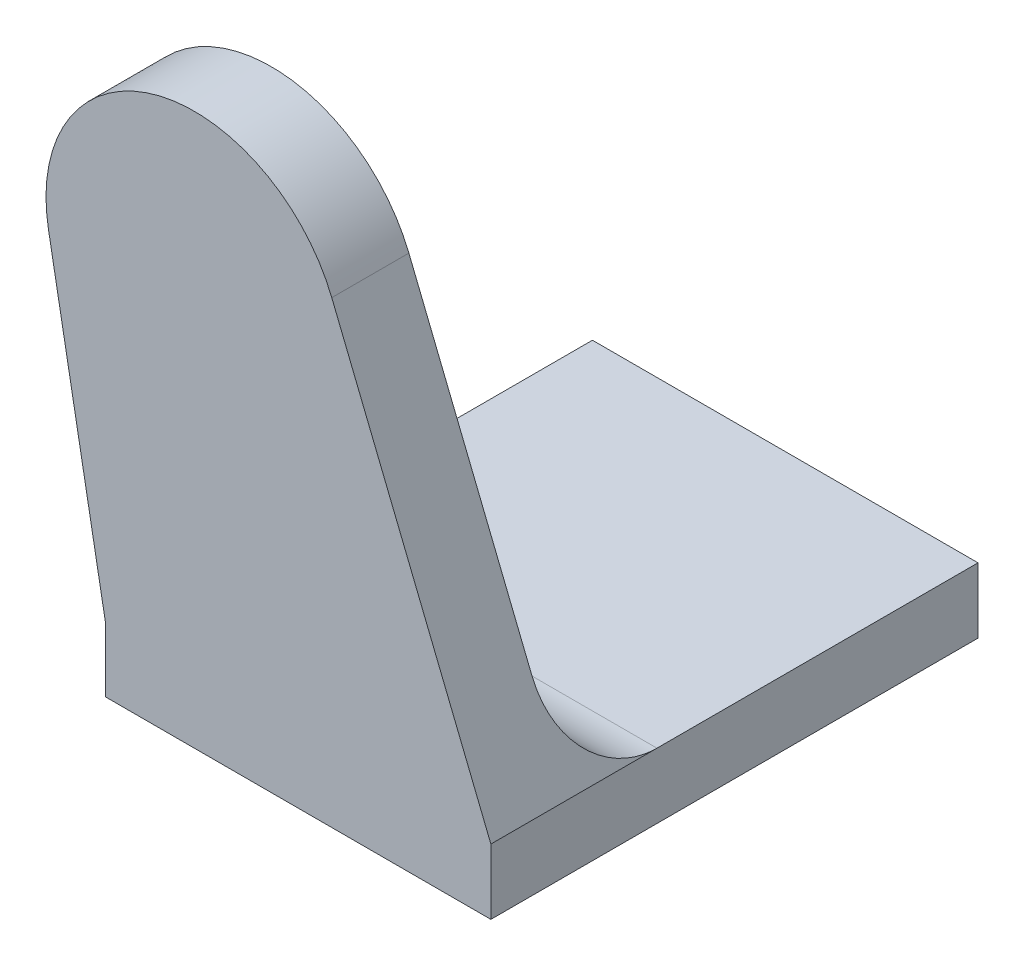
ISO-10303-21;
HEADER;
FILE_DESCRIPTION(('STEP AP214'),'2;1');
FILE_NAME('part.step','',(''),(''),'','','');
FILE_SCHEMA(('AUTOMOTIVE_DESIGN { 1 0 10303 214 1 1 1 1 }'));
ENDSEC;
DATA;
#1=APPLICATION_CONTEXT('core data for automotive mechanical design processes');
#2=APPLICATION_PROTOCOL_DEFINITION('international standard','automotive_design',2000,#1);
#3=PRODUCT_CONTEXT('',#1,'mechanical');
#4=PRODUCT('Part','Part','',(#3));
#5=PRODUCT_RELATED_PRODUCT_CATEGORY('part','',(#4));
#6=PRODUCT_DEFINITION_FORMATION('','',#4);
#7=PRODUCT_DEFINITION_CONTEXT('part definition',#1,'design');
#8=PRODUCT_DEFINITION('design','',#6,#7);
#9=PRODUCT_DEFINITION_SHAPE('','',#8);
#10=(LENGTH_UNIT() NAMED_UNIT(*) SI_UNIT(.MILLI.,.METRE.));
#11=(NAMED_UNIT(*) PLANE_ANGLE_UNIT() SI_UNIT($,.RADIAN.));
#12=(NAMED_UNIT(*) SI_UNIT($,.STERADIAN.) SOLID_ANGLE_UNIT());
#13=UNCERTAINTY_MEASURE_WITH_UNIT(LENGTH_MEASURE(1.E-05),#10,'distance_accuracy_value','');
#14=(GEOMETRIC_REPRESENTATION_CONTEXT(3) GLOBAL_UNCERTAINTY_ASSIGNED_CONTEXT((#13)) GLOBAL_UNIT_ASSIGNED_CONTEXT((#10,
#11,#12)) REPRESENTATION_CONTEXT('',''));
#15=CARTESIAN_POINT('',(0.,0.,0.));
#16=DIRECTION('',(0.,0.,1.));
#17=DIRECTION('',(1.,0.,0.));
#18=AXIS2_PLACEMENT_3D('',#15,#16,#17);
#19=CARTESIAN_POINT('',(0.,-93.2998175726996,0.));
#20=DIRECTION('',(0.,-1.,0.));
#21=DIRECTION('',(0.,0.,-1.));
#22=AXIS2_PLACEMENT_3D('',#19,#20,#21);
#23=PLANE('',#22);
#24=DIRECTION('',(0.,0.,-1.));
#25=VECTOR('',#24,1.);
#26=CARTESIAN_POINT('',(23.0000603569878,-93.2998175726996,12.45));
#27=LINE('',#26,#25);
#28=CARTESIAN_POINT('',(23.0000603569878,-93.2998175726996,6.85000000000001));
#29=VERTEX_POINT('',#28);
#30=CARTESIAN_POINT('',(23.0000603569878,-93.2998175726996,-3.97499999999999));
#31=VERTEX_POINT('',#30);
#32=EDGE_CURVE('E112',#29,#31,#27,.T.);
#33=ORIENTED_EDGE('',*,*,#32,.T.);
#34=DIRECTION('',(1.,0.,0.));
#35=VECTOR('',#34,1.);
#36=CARTESIAN_POINT('',(23.0000603569878,-93.2998175726996,-3.97499999999999));
#37=LINE('',#36,#35);
#38=CARTESIAN_POINT('',(9.99982028537325,-93.2998175726996,-3.97499999999999));
#39=VERTEX_POINT('',#38);
#40=EDGE_CURVE('E119',#39,#31,#37,.T.);
#41=ORIENTED_EDGE('',*,*,#40,.F.);
#42=DIRECTION('',(0.,0.,1.));
#43=VECTOR('',#42,1.);
#44=CARTESIAN_POINT('',(9.99982028537324,-93.2998175726996,12.45));
#45=LINE('',#44,#43);
#46=CARTESIAN_POINT('',(9.99982028537324,-93.2998175726996,6.85));
#47=VERTEX_POINT('',#46);
#48=EDGE_CURVE('E168',#39,#47,#45,.T.);
#49=ORIENTED_EDGE('',*,*,#48,.T.);
#50=DIRECTION('',(-1.,0.,0.));
#51=VECTOR('',#50,1.);
#52=CARTESIAN_POINT('',(9.99982028537324,-93.2998175726996,6.85));
#53=LINE('',#52,#51);
#54=EDGE_CURVE('E127',#29,#47,#53,.T.);
#55=ORIENTED_EDGE('',*,*,#54,.F.);
#56=EDGE_LOOP('',(#33,#41,#49,#55));
#57=FACE_BOUND('',#56,.T.);
#58=ADVANCED_FACE('F34',(#57),#23,.F.);
#59=CARTESIAN_POINT('',(23.0000603569878,-95.4998175726996,12.45));
#60=DIRECTION('',(-1.,0.,0.));
#61=DIRECTION('',(0.,0.,-1.));
#62=AXIS2_PLACEMENT_3D('',#59,#60,#61);
#63=PLANE('',#62);
#64=CARTESIAN_POINT('',(23.0000603569878,-93.2998175726996,12.45));
#65=VERTEX_POINT('',#64);
#66=EDGE_CURVE('E172',#65,#29,#27,.T.);
#67=ORIENTED_EDGE('',*,*,#66,.F.);
#68=DIRECTION('',(0.,1.,0.));
#69=VECTOR('',#68,1.);
#70=CARTESIAN_POINT('',(23.0000603569878,-95.4998175726996,12.45));
#71=LINE('',#70,#69);
#72=CARTESIAN_POINT('',(23.0000603569878,-95.4998175726996,12.45));
#73=VERTEX_POINT('',#72);
#74=EDGE_CURVE('E116',#73,#65,#71,.T.);
#75=ORIENTED_EDGE('',*,*,#74,.F.);
#76=DIRECTION('',(0.,0.,-1.));
#77=VECTOR('',#76,1.);
#78=CARTESIAN_POINT('',(23.0000603569878,-95.4998175726996,12.45));
#79=LINE('',#78,#77);
#80=CARTESIAN_POINT('',(23.0000603569878,-95.4998175726996,-3.97499999999999));
#81=VERTEX_POINT('',#80);
#82=EDGE_CURVE('E115',#73,#81,#79,.T.);
#83=ORIENTED_EDGE('',*,*,#82,.T.);
#84=DIRECTION('',(0.,-1.,0.));
#85=VECTOR('',#84,1.);
#86=CARTESIAN_POINT('',(23.0000603569878,-93.2998175726996,-3.97499999999999));
#87=LINE('',#86,#85);
#88=EDGE_CURVE('E107',#31,#81,#87,.T.);
#89=ORIENTED_EDGE('',*,*,#88,.F.);
#90=ORIENTED_EDGE('',*,*,#32,.F.);
#91=EDGE_LOOP('',(#67,#75,#83,#89,#90));
#92=FACE_BOUND('',#91,.T.);
#93=ADVANCED_FACE('F110',(#92),#63,.F.);
#94=CARTESIAN_POINT('',(9.99982028537324,-95.4998175726996,12.45));
#95=DIRECTION('',(1.,0.,0.));
#96=DIRECTION('',(0.,0.,1.));
#97=AXIS2_PLACEMENT_3D('',#94,#95,#96);
#98=PLANE('',#97);
#99=DIRECTION('',(0.,0.,1.));
#100=VECTOR('',#99,1.);
#101=CARTESIAN_POINT('',(9.99982028537324,-95.4998175726996,12.45));
#102=LINE('',#101,#100);
#103=CARTESIAN_POINT('',(9.99982028537324,-95.4998175726996,-3.97499999999998));
#104=VERTEX_POINT('',#103);
#105=CARTESIAN_POINT('',(9.99982028537324,-95.4998175726996,12.45));
#106=VERTEX_POINT('',#105);
#107=EDGE_CURVE('E164',#104,#106,#102,.T.);
#108=ORIENTED_EDGE('',*,*,#107,.T.);
#109=DIRECTION('',(0.,1.,0.));
#110=VECTOR('',#109,1.);
#111=CARTESIAN_POINT('',(9.99982028537324,-95.4998175726996,12.45));
#112=LINE('',#111,#110);
#113=CARTESIAN_POINT('',(9.99982028537324,-93.2998175726996,12.45));
#114=VERTEX_POINT('',#113);
#115=EDGE_CURVE('E154',#106,#114,#112,.T.);
#116=ORIENTED_EDGE('',*,*,#115,.T.);
#117=DIRECTION('',(0.,0.,-1.));
#118=VECTOR('',#117,1.);
#119=CARTESIAN_POINT('',(9.99982028537324,-93.2998175726996,12.45));
#120=LINE('',#119,#118);
#121=EDGE_CURVE('E140',#114,#47,#120,.T.);
#122=ORIENTED_EDGE('',*,*,#121,.T.);
#123=ORIENTED_EDGE('',*,*,#48,.F.);
#124=DIRECTION('',(0.,-1.,0.));
#125=VECTOR('',#124,1.);
#126=CARTESIAN_POINT('',(9.99982028537325,-93.2998175726996,-3.97499999999999));
#127=LINE('',#126,#125);
#128=EDGE_CURVE('E121',#39,#104,#127,.T.);
#129=ORIENTED_EDGE('',*,*,#128,.T.);
#130=EDGE_LOOP('',(#108,#116,#122,#123,#129));
#131=FACE_BOUND('',#130,.T.);
#132=ADVANCED_FACE('F196',(#131),#98,.F.);
#133=CARTESIAN_POINT('',(0.,-95.4998175726996,0.));
#134=DIRECTION('',(0.,-1.,0.));
#135=DIRECTION('',(0.,0.,-1.));
#136=AXIS2_PLACEMENT_3D('',#133,#134,#135);
#137=PLANE('',#136);
#138=DIRECTION('',(1.,0.,0.));
#139=VECTOR('',#138,1.);
#140=CARTESIAN_POINT('',(23.0000603569878,-95.4998175726996,-3.97499999999999));
#141=LINE('',#140,#139);
#142=EDGE_CURVE('E73',#104,#81,#141,.T.);
#143=ORIENTED_EDGE('',*,*,#142,.T.);
#144=ORIENTED_EDGE('',*,*,#82,.F.);
#145=DIRECTION('',(1.,0.,0.));
#146=VECTOR('',#145,1.);
#147=CARTESIAN_POINT('',(23.0000603569878,-95.4998175726996,12.45));
#148=LINE('',#147,#146);
#149=EDGE_CURVE('E167',#106,#73,#148,.T.);
#150=ORIENTED_EDGE('',*,*,#149,.F.);
#151=ORIENTED_EDGE('',*,*,#107,.F.);
#152=EDGE_LOOP('',(#143,#144,#150,#151));
#153=FACE_BOUND('',#152,.T.);
#154=ADVANCED_FACE('F194',(#153),#137,.T.);
#155=CARTESIAN_POINT('',(23.0000603569878,-95.4998175726996,12.45));
#156=DIRECTION('',(0.,0.,-1.));
#157=DIRECTION('',(1.,0.,0.));
#158=AXIS2_PLACEMENT_3D('',#155,#156,#157);
#159=PLANE('',#158);
#160=ORIENTED_EDGE('',*,*,#115,.F.);
#161=ORIENTED_EDGE('',*,*,#149,.T.);
#162=ORIENTED_EDGE('',*,*,#74,.T.);
#163=DIRECTION('',(0.374703363464617,-0.927144751054712,0.));
#164=VECTOR('',#163,1.);
#165=CARTESIAN_POINT('',(23.0000603569878,-93.2998175726996,12.45));
#166=LINE('',#165,#164);
#167=CARTESIAN_POINT('',(17.6355329929038,-80.0261353150554,12.45));
#168=VERTEX_POINT('',#167);
#169=EDGE_CURVE('E141',#168,#65,#166,.T.);
#170=ORIENTED_EDGE('',*,*,#169,.F.);
#171=CARTESIAN_POINT('',(12.9998092376302,-81.8996521323785,12.45));
#172=DIRECTION('',(0.,0.,-1.));
#173=DIRECTION('',(-1.,0.,0.));
#174=AXIS2_PLACEMENT_3D('',#171,#172,#173);
#175=CIRCLE('',#174,5.);
#176=CARTESIAN_POINT('',(8.08122186795485,-82.7982612169476,12.45));
#177=VERTEX_POINT('',#176);
#178=EDGE_CURVE('E145',#177,#168,#175,.T.);
#179=ORIENTED_EDGE('',*,*,#178,.F.);
#180=DIRECTION('',(-0.179721816913822,0.98371747393507,0.));
#181=VECTOR('',#180,1.);
#182=CARTESIAN_POINT('',(9.99982028537324,-93.2998175726996,12.45));
#183=LINE('',#182,#181);
#184=EDGE_CURVE('E152',#114,#177,#183,.T.);
#185=ORIENTED_EDGE('',*,*,#184,.F.);
#186=EDGE_LOOP('',(#160,#161,#162,#170,#179,#185));
#187=FACE_BOUND('',#186,.T.);
#188=ADVANCED_FACE('F191',(#187),#159,.F.);
#189=CARTESIAN_POINT('',(9.99982028537324,-93.2998175726996,12.45));
#190=DIRECTION('',(0.98371747393507,0.179721816913822,0.));
#191=DIRECTION('',(0.179721816913822,-0.98371747393507,0.));
#192=AXIS2_PLACEMENT_3D('',#189,#190,#191);
#193=PLANE('',#192);
#194=ORIENTED_EDGE('',*,*,#121,.F.);
#195=ORIENTED_EDGE('',*,*,#184,.T.);
#196=DIRECTION('',(0.,0.,-1.));
#197=VECTOR('',#196,1.);
#198=CARTESIAN_POINT('',(8.08122186795485,-82.7982612169476,12.45));
#199=LINE('',#198,#197);
#200=CARTESIAN_POINT('',(8.08122186795485,-82.7982612169476,9.85));
#201=VERTEX_POINT('',#200);
#202=EDGE_CURVE('E138',#177,#201,#199,.T.);
#203=ORIENTED_EDGE('',*,*,#202,.T.);
#204=DIRECTION('',(-0.179721816913822,0.98371747393507,0.));
#205=VECTOR('',#204,1.);
#206=CARTESIAN_POINT('',(9.99982028537324,-93.2998175726996,9.85));
#207=LINE('',#206,#205);
#208=CARTESIAN_POINT('',(9.45173054921689,-90.2998175726996,9.85));
#209=VERTEX_POINT('',#208);
#210=EDGE_CURVE('E135',#209,#201,#207,.T.);
#211=ORIENTED_EDGE('',*,*,#210,.F.);
#212=CARTESIAN_POINT('',(9.45173054921689,-90.2998175726996,6.85));
#213=DIRECTION('',(-0.98371747393507,-0.179721816913822,0.));
#214=DIRECTION('',(0.179721816913822,-0.98371747393507,0.));
#215=AXIS2_PLACEMENT_3D('',#212,#213,#214);
#216=ELLIPSE('',#215,3.04965610501905,3.);
#217=EDGE_CURVE('E42',#47,#209,#216,.T.);
#218=ORIENTED_EDGE('',*,*,#217,.F.);
#219=EDGE_LOOP('',(#194,#195,#203,#211,#218));
#220=FACE_BOUND('',#219,.T.);
#221=ADVANCED_FACE('F136',(#220),#193,.F.);
#222=CARTESIAN_POINT('',(12.9998092376302,-81.8996521323785,12.45));
#223=DIRECTION('',(0.,0.,-1.));
#224=DIRECTION('',(1.,0.,0.));
#225=AXIS2_PLACEMENT_3D('',#222,#223,#224);
#226=CYLINDRICAL_SURFACE('',#225,5.);
#227=CARTESIAN_POINT('',(12.9998092376302,-81.8996521323785,9.85));
#228=DIRECTION('',(0.,0.,-1.));
#229=DIRECTION('',(-1.,0.,0.));
#230=AXIS2_PLACEMENT_3D('',#227,#228,#229);
#231=CIRCLE('',#230,5.);
#232=CARTESIAN_POINT('',(17.6355329929038,-80.0261353150554,9.85));
#233=VERTEX_POINT('',#232);
#234=EDGE_CURVE('E143',#201,#233,#231,.T.);
#235=ORIENTED_EDGE('',*,*,#234,.F.);
#236=ORIENTED_EDGE('',*,*,#202,.F.);
#237=ORIENTED_EDGE('',*,*,#178,.T.);
#238=DIRECTION('',(0.,0.,-1.));
#239=VECTOR('',#238,1.);
#240=CARTESIAN_POINT('',(17.6355329929038,-80.0261353150554,12.45));
#241=LINE('',#240,#239);
#242=EDGE_CURVE('E159',#168,#233,#241,.T.);
#243=ORIENTED_EDGE('',*,*,#242,.T.);
#244=EDGE_LOOP('',(#235,#236,#237,#243));
#245=FACE_BOUND('',#244,.T.);
#246=ADVANCED_FACE('F186',(#245),#226,.T.);
#247=CARTESIAN_POINT('',(23.0000603569878,-93.2998175726996,12.45));
#248=DIRECTION('',(-0.927144751054712,-0.374703363464617,0.));
#249=DIRECTION('',(-0.374703363464617,0.927144751054712,0.));
#250=AXIS2_PLACEMENT_3D('',#247,#248,#249);
#251=PLANE('',#250);
#252=DIRECTION('',(0.374703363464617,-0.927144751054712,0.));
#253=VECTOR('',#252,1.);
#254=CARTESIAN_POINT('',(23.0000603569878,-93.2998175726996,9.85));
#255=LINE('',#254,#253);
#256=CARTESIAN_POINT('',(21.7876174357341,-90.2998175726996,9.85));
#257=VERTEX_POINT('',#256);
#258=EDGE_CURVE('E180',#233,#257,#255,.T.);
#259=ORIENTED_EDGE('',*,*,#258,.F.);
#260=ORIENTED_EDGE('',*,*,#242,.F.);
#261=ORIENTED_EDGE('',*,*,#169,.T.);
#262=ORIENTED_EDGE('',*,*,#66,.T.);
#263=CARTESIAN_POINT('',(21.7876174357341,-90.2998175726996,6.85));
#264=DIRECTION('',(0.927144751054712,0.374703363464617,0.));
#265=DIRECTION('',(0.374703363464617,-0.927144751054712,0.));
#266=AXIS2_PLACEMENT_3D('',#263,#264,#265);
#267=ELLIPSE('',#266,3.23574069376678,3.);
#268=EDGE_CURVE('E11',#257,#29,#267,.T.);
#269=ORIENTED_EDGE('',*,*,#268,.F.);
#270=EDGE_LOOP('',(#259,#260,#261,#262,#269));
#271=FACE_BOUND('',#270,.T.);
#272=ADVANCED_FACE('F184',(#271),#251,.F.);
#273=CARTESIAN_POINT('',(12.9998092376302,-81.8996521323785,9.85));
#274=DIRECTION('',(0.,0.,1.));
#275=DIRECTION('',(-1.,0.,0.));
#276=AXIS2_PLACEMENT_3D('',#273,#274,#275);
#277=PLANE('',#276);
#278=CARTESIAN_POINT('',(12.9998092376302,-81.8996521323785,9.85));
#279=DIRECTION('',(0.,0.,1.));
#280=DIRECTION('',(1.,0.,0.));
#281=AXIS2_PLACEMENT_3D('',#278,#279,#280);
#282=CIRCLE('',#281,2.);
#283=CARTESIAN_POINT('',(14.9998092376302,-81.8996521323785,9.85));
#284=VERTEX_POINT('',#283);
#285=EDGE_CURVE('E155',#284,#284,#282,.T.);
#286=ORIENTED_EDGE('',*,*,#285,.T.);
#287=EDGE_LOOP('',(#286));
#288=FACE_BOUND('',#287,.T.);
#289=ORIENTED_EDGE('',*,*,#210,.T.);
#290=ORIENTED_EDGE('',*,*,#234,.T.);
#291=ORIENTED_EDGE('',*,*,#258,.T.);
#292=DIRECTION('',(-1.,0.,0.));
#293=VECTOR('',#292,1.);
#294=CARTESIAN_POINT('',(23.0000603569878,-90.2998175726996,9.85));
#295=LINE('',#294,#293);
#296=EDGE_CURVE('E55',#209,#257,#295,.F.);
#297=ORIENTED_EDGE('',*,*,#296,.F.);
#298=EDGE_LOOP('',(#289,#290,#291,#297));
#299=FACE_BOUND('',#298,.T.);
#300=ADVANCED_FACE('F182',(#288,#299),#277,.F.);
#301=CARTESIAN_POINT('',(12.9998092376302,-81.8996521323785,11.37));
#302=DIRECTION('',(0.,0.,-1.));
#303=DIRECTION('',(1.,0.,0.));
#304=AXIS2_PLACEMENT_3D('',#301,#302,#303);
#305=CYLINDRICAL_SURFACE('',#304,2.);
#306=CARTESIAN_POINT('',(12.9998092376302,-81.8996521323785,11.37));
#307=DIRECTION('',(0.,0.,1.));
#308=DIRECTION('',(1.,0.,0.));
#309=AXIS2_PLACEMENT_3D('',#306,#307,#308);
#310=CIRCLE('',#309,2.);
#311=CARTESIAN_POINT('',(14.9998092376302,-81.8996521323785,11.37));
#312=VERTEX_POINT('',#311);
#313=EDGE_CURVE('E158',#312,#312,#310,.T.);
#314=ORIENTED_EDGE('',*,*,#313,.T.);
#315=EDGE_LOOP('',(#314));
#316=FACE_BOUND('',#315,.T.);
#317=ORIENTED_EDGE('',*,*,#285,.F.);
#318=EDGE_LOOP('',(#317));
#319=FACE_BOUND('',#318,.T.);
#320=ADVANCED_FACE('F268',(#316,#319),#305,.F.);
#321=CARTESIAN_POINT('',(12.9998092376302,-81.8996521323785,11.37));
#322=DIRECTION('',(0.,0.,-1.));
#323=DIRECTION('',(1.,0.,0.));
#324=AXIS2_PLACEMENT_3D('',#321,#322,#323);
#325=PLANE('',#324);
#326=ORIENTED_EDGE('',*,*,#313,.F.);
#327=EDGE_LOOP('',(#326));
#328=FACE_BOUND('',#327,.T.);
#329=ADVANCED_FACE('F278',(#328),#325,.T.);
#330=CARTESIAN_POINT('',(23.0000603569878,-93.2998175726996,-3.97499999999999));
#331=DIRECTION('',(0.,0.,1.));
#332=DIRECTION('',(-1.,0.,0.));
#333=AXIS2_PLACEMENT_3D('',#330,#331,#332);
#334=PLANE('',#333);
#335=ORIENTED_EDGE('',*,*,#142,.F.);
#336=ORIENTED_EDGE('',*,*,#128,.F.);
#337=ORIENTED_EDGE('',*,*,#40,.T.);
#338=ORIENTED_EDGE('',*,*,#88,.T.);
#339=EDGE_LOOP('',(#335,#336,#337,#338));
#340=FACE_BOUND('',#339,.T.);
#341=ADVANCED_FACE('F120',(#340),#334,.F.);
#342=CARTESIAN_POINT('',(0.,-90.2998175726996,6.85));
#343=DIRECTION('',(1.,0.,0.));
#344=DIRECTION('',(0.,0.,1.));
#345=AXIS2_PLACEMENT_3D('',#342,#343,#344);
#346=CYLINDRICAL_SURFACE('',#345,3.);
#347=ORIENTED_EDGE('',*,*,#268,.T.);
#348=ORIENTED_EDGE('',*,*,#54,.T.);
#349=ORIENTED_EDGE('',*,*,#217,.T.);
#350=ORIENTED_EDGE('',*,*,#296,.T.);
#351=EDGE_LOOP('',(#347,#348,#349,#350));
#352=FACE_BOUND('',#351,.T.);
#353=ADVANCED_FACE('F36',(#352),#346,.F.);
#354=CLOSED_SHELL('',(#58,#93,#132,#154,#188,#221,#246,#272,#300,#320,#329,#341,#353));
#355=MANIFOLD_SOLID_BREP('B2',#354);
#356=ADVANCED_BREP_SHAPE_REPRESENTATION('',(#18,#355),#14);
#357=SHAPE_DEFINITION_REPRESENTATION(#9,#356);
ENDSEC;
END-ISO-10303-21;
